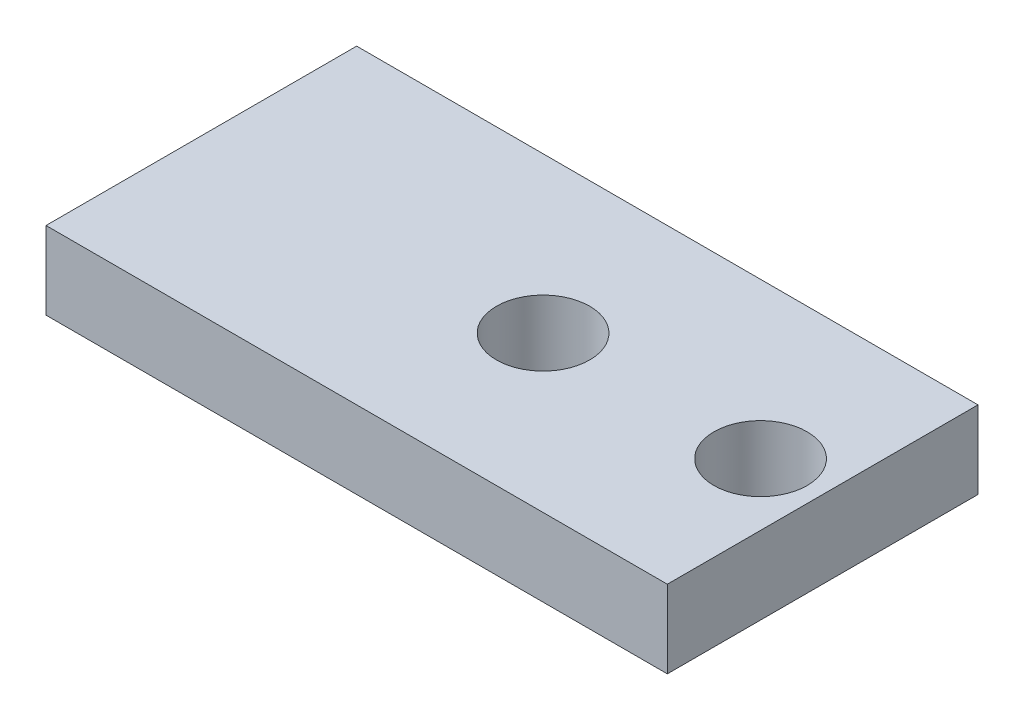
ISO-10303-21;
HEADER;
FILE_DESCRIPTION(('STEP AP214'),'2;1');
FILE_NAME('part.step','',(''),(''),'','','');
FILE_SCHEMA(('AUTOMOTIVE_DESIGN { 1 0 10303 214 1 1 1 1 }'));
ENDSEC;
DATA;
#1=APPLICATION_CONTEXT('core data for automotive mechanical design processes');
#2=APPLICATION_PROTOCOL_DEFINITION('international standard','automotive_design',2000,#1);
#3=PRODUCT_CONTEXT('',#1,'mechanical');
#4=PRODUCT('Part','Part','',(#3));
#5=PRODUCT_RELATED_PRODUCT_CATEGORY('part','',(#4));
#6=PRODUCT_DEFINITION_FORMATION('','',#4);
#7=PRODUCT_DEFINITION_CONTEXT('part definition',#1,'design');
#8=PRODUCT_DEFINITION('design','',#6,#7);
#9=PRODUCT_DEFINITION_SHAPE('','',#8);
#10=(LENGTH_UNIT() NAMED_UNIT(*) SI_UNIT(.MILLI.,.METRE.));
#11=(NAMED_UNIT(*) PLANE_ANGLE_UNIT() SI_UNIT($,.RADIAN.));
#12=(NAMED_UNIT(*) SI_UNIT($,.STERADIAN.) SOLID_ANGLE_UNIT());
#13=UNCERTAINTY_MEASURE_WITH_UNIT(LENGTH_MEASURE(1.E-05),#10,'distance_accuracy_value','');
#14=(GEOMETRIC_REPRESENTATION_CONTEXT(3) GLOBAL_UNCERTAINTY_ASSIGNED_CONTEXT((#13)) GLOBAL_UNIT_ASSIGNED_CONTEXT((#10,
#11,#12)) REPRESENTATION_CONTEXT('',''));
#15=CARTESIAN_POINT('',(0.,0.,0.));
#16=DIRECTION('',(0.,0.,1.));
#17=DIRECTION('',(1.,0.,0.));
#18=AXIS2_PLACEMENT_3D('',#15,#16,#17);
#19=CARTESIAN_POINT('',(20.,5.,-10.));
#20=DIRECTION('',(-1.,0.,0.));
#21=DIRECTION('',(0.,0.,1.));
#22=AXIS2_PLACEMENT_3D('',#19,#20,#21);
#23=PLANE('',#22);
#24=DIRECTION('',(0.,0.,-1.));
#25=VECTOR('',#24,1.);
#26=CARTESIAN_POINT('',(20.,0.,-10.));
#27=LINE('',#26,#25);
#28=CARTESIAN_POINT('',(20.,0.,10.));
#29=VERTEX_POINT('',#28);
#30=CARTESIAN_POINT('',(20.,0.,-10.));
#31=VERTEX_POINT('',#30);
#32=EDGE_CURVE('E97',#29,#31,#27,.T.);
#33=ORIENTED_EDGE('',*,*,#32,.T.);
#34=DIRECTION('',(0.,-1.,0.));
#35=VECTOR('',#34,1.);
#36=CARTESIAN_POINT('',(20.,5.,-10.));
#37=LINE('',#36,#35);
#38=CARTESIAN_POINT('',(20.,5.,-10.));
#39=VERTEX_POINT('',#38);
#40=EDGE_CURVE('E11',#39,#31,#37,.T.);
#41=ORIENTED_EDGE('',*,*,#40,.F.);
#42=DIRECTION('',(0.,0.,-1.));
#43=VECTOR('',#42,1.);
#44=CARTESIAN_POINT('',(20.,5.,-10.));
#45=LINE('',#44,#43);
#46=CARTESIAN_POINT('',(20.,5.,10.));
#47=VERTEX_POINT('',#46);
#48=EDGE_CURVE('E85',#47,#39,#45,.T.);
#49=ORIENTED_EDGE('',*,*,#48,.F.);
#50=DIRECTION('',(0.,-1.,0.));
#51=VECTOR('',#50,1.);
#52=CARTESIAN_POINT('',(20.,5.,10.));
#53=LINE('',#52,#51);
#54=EDGE_CURVE('E93',#47,#29,#53,.T.);
#55=ORIENTED_EDGE('',*,*,#54,.T.);
#56=EDGE_LOOP('',(#33,#41,#49,#55));
#57=FACE_BOUND('',#56,.T.);
#58=ADVANCED_FACE('F34',(#57),#23,.F.);
#59=CARTESIAN_POINT('',(-20.,5.,-10.));
#60=DIRECTION('',(0.,0.,1.));
#61=DIRECTION('',(1.,0.,0.));
#62=AXIS2_PLACEMENT_3D('',#59,#60,#61);
#63=PLANE('',#62);
#64=DIRECTION('',(-1.,0.,0.));
#65=VECTOR('',#64,1.);
#66=CARTESIAN_POINT('',(-20.,0.,-10.));
#67=LINE('',#66,#65);
#68=CARTESIAN_POINT('',(-20.,0.,-10.));
#69=VERTEX_POINT('',#68);
#70=EDGE_CURVE('E89',#31,#69,#67,.T.);
#71=ORIENTED_EDGE('',*,*,#70,.T.);
#72=DIRECTION('',(0.,-1.,0.));
#73=VECTOR('',#72,1.);
#74=CARTESIAN_POINT('',(-20.,5.,-10.));
#75=LINE('',#74,#73);
#76=CARTESIAN_POINT('',(-20.,5.,-10.));
#77=VERTEX_POINT('',#76);
#78=EDGE_CURVE('E42',#77,#69,#75,.T.);
#79=ORIENTED_EDGE('',*,*,#78,.F.);
#80=DIRECTION('',(-1.,0.,0.));
#81=VECTOR('',#80,1.);
#82=CARTESIAN_POINT('',(-20.,5.,-10.));
#83=LINE('',#82,#81);
#84=EDGE_CURVE('E80',#39,#77,#83,.T.);
#85=ORIENTED_EDGE('',*,*,#84,.F.);
#86=ORIENTED_EDGE('',*,*,#40,.T.);
#87=EDGE_LOOP('',(#71,#79,#85,#86));
#88=FACE_BOUND('',#87,.T.);
#89=ADVANCED_FACE('F88',(#88),#63,.F.);
#90=CARTESIAN_POINT('',(-20.,5.,-10.));
#91=DIRECTION('',(1.,0.,0.));
#92=DIRECTION('',(0.,0.,-1.));
#93=AXIS2_PLACEMENT_3D('',#90,#91,#92);
#94=PLANE('',#93);
#95=DIRECTION('',(0.,0.,1.));
#96=VECTOR('',#95,1.);
#97=CARTESIAN_POINT('',(-20.,0.,-10.));
#98=LINE('',#97,#96);
#99=CARTESIAN_POINT('',(-20.,0.,10.));
#100=VERTEX_POINT('',#99);
#101=EDGE_CURVE('E67',#69,#100,#98,.T.);
#102=ORIENTED_EDGE('',*,*,#101,.T.);
#103=DIRECTION('',(0.,-1.,0.));
#104=VECTOR('',#103,1.);
#105=CARTESIAN_POINT('',(-20.,5.,10.));
#106=LINE('',#105,#104);
#107=CARTESIAN_POINT('',(-20.,5.,10.));
#108=VERTEX_POINT('',#107);
#109=EDGE_CURVE('E90',#108,#100,#106,.T.);
#110=ORIENTED_EDGE('',*,*,#109,.F.);
#111=DIRECTION('',(0.,0.,1.));
#112=VECTOR('',#111,1.);
#113=CARTESIAN_POINT('',(-20.,5.,-10.));
#114=LINE('',#113,#112);
#115=EDGE_CURVE('E83',#77,#108,#114,.T.);
#116=ORIENTED_EDGE('',*,*,#115,.F.);
#117=ORIENTED_EDGE('',*,*,#78,.T.);
#118=EDGE_LOOP('',(#102,#110,#116,#117));
#119=FACE_BOUND('',#118,.T.);
#120=ADVANCED_FACE('F91',(#119),#94,.F.);
#121=CARTESIAN_POINT('',(-20.,5.,10.));
#122=DIRECTION('',(0.,0.,-1.));
#123=DIRECTION('',(-1.,0.,0.));
#124=AXIS2_PLACEMENT_3D('',#121,#122,#123);
#125=PLANE('',#124);
#126=DIRECTION('',(1.,0.,0.));
#127=VECTOR('',#126,1.);
#128=CARTESIAN_POINT('',(-20.,0.,10.));
#129=LINE('',#128,#127);
#130=EDGE_CURVE('E73',#100,#29,#129,.T.);
#131=ORIENTED_EDGE('',*,*,#130,.T.);
#132=ORIENTED_EDGE('',*,*,#54,.F.);
#133=DIRECTION('',(1.,0.,0.));
#134=VECTOR('',#133,1.);
#135=CARTESIAN_POINT('',(-20.,5.,10.));
#136=LINE('',#135,#134);
#137=EDGE_CURVE('E50',#108,#47,#136,.T.);
#138=ORIENTED_EDGE('',*,*,#137,.F.);
#139=ORIENTED_EDGE('',*,*,#109,.T.);
#140=EDGE_LOOP('',(#131,#132,#138,#139));
#141=FACE_BOUND('',#140,.T.);
#142=ADVANCED_FACE('F105',(#141),#125,.F.);
#143=CARTESIAN_POINT('',(0.,5.,0.));
#144=DIRECTION('',(0.,1.,0.));
#145=DIRECTION('',(0.,0.,1.));
#146=AXIS2_PLACEMENT_3D('',#143,#144,#145);
#147=PLANE('',#146);
#148=CARTESIAN_POINT('',(16.,5.,0.));
#149=DIRECTION('',(0.,1.,0.));
#150=DIRECTION('',(0.,0.,1.));
#151=AXIS2_PLACEMENT_3D('',#148,#149,#150);
#152=CIRCLE('',#151,2.99999999999999);
#153=CARTESIAN_POINT('',(16.,5.,2.99999999999999));
#154=VERTEX_POINT('',#153);
#155=EDGE_CURVE('E116',#154,#154,#152,.T.);
#156=ORIENTED_EDGE('',*,*,#155,.F.);
#157=EDGE_LOOP('',(#156));
#158=FACE_BOUND('',#157,.T.);
#159=CARTESIAN_POINT('',(2.,5.,0.));
#160=DIRECTION('',(0.,1.,0.));
#161=DIRECTION('',(0.,0.,1.));
#162=AXIS2_PLACEMENT_3D('',#159,#160,#161);
#163=CIRCLE('',#162,2.99999999999999);
#164=CARTESIAN_POINT('',(2.,5.,2.99999999999999));
#165=VERTEX_POINT('',#164);
#166=EDGE_CURVE('E100',#165,#165,#163,.T.);
#167=ORIENTED_EDGE('',*,*,#166,.F.);
#168=EDGE_LOOP('',(#167));
#169=FACE_BOUND('',#168,.T.);
#170=ORIENTED_EDGE('',*,*,#48,.T.);
#171=ORIENTED_EDGE('',*,*,#84,.T.);
#172=ORIENTED_EDGE('',*,*,#115,.T.);
#173=ORIENTED_EDGE('',*,*,#137,.T.);
#174=EDGE_LOOP('',(#170,#171,#172,#173));
#175=FACE_BOUND('',#174,.T.);
#176=ADVANCED_FACE('F81',(#158,#169,#175),#147,.T.);
#177=CARTESIAN_POINT('',(0.,0.,0.));
#178=DIRECTION('',(0.,1.,0.));
#179=DIRECTION('',(0.,0.,1.));
#180=AXIS2_PLACEMENT_3D('',#177,#178,#179);
#181=PLANE('',#180);
#182=CARTESIAN_POINT('',(16.,0.,0.));
#183=DIRECTION('',(0.,-1.,0.));
#184=DIRECTION('',(0.,0.,-1.));
#185=AXIS2_PLACEMENT_3D('',#182,#183,#184);
#186=CIRCLE('',#185,2.99999999999999);
#187=CARTESIAN_POINT('',(16.,0.,-2.99999999999999));
#188=VERTEX_POINT('',#187);
#189=EDGE_CURVE('E119',#188,#188,#186,.T.);
#190=ORIENTED_EDGE('',*,*,#189,.F.);
#191=EDGE_LOOP('',(#190));
#192=FACE_BOUND('',#191,.T.);
#193=CARTESIAN_POINT('',(2.,0.,0.));
#194=DIRECTION('',(0.,-1.,0.));
#195=DIRECTION('',(0.,0.,-1.));
#196=AXIS2_PLACEMENT_3D('',#193,#194,#195);
#197=CIRCLE('',#196,2.99999999999999);
#198=CARTESIAN_POINT('',(2.,0.,-2.99999999999999));
#199=VERTEX_POINT('',#198);
#200=EDGE_CURVE('E113',#199,#199,#197,.T.);
#201=ORIENTED_EDGE('',*,*,#200,.F.);
#202=EDGE_LOOP('',(#201));
#203=FACE_BOUND('',#202,.T.);
#204=ORIENTED_EDGE('',*,*,#32,.F.);
#205=ORIENTED_EDGE('',*,*,#130,.F.);
#206=ORIENTED_EDGE('',*,*,#101,.F.);
#207=ORIENTED_EDGE('',*,*,#70,.F.);
#208=EDGE_LOOP('',(#204,#205,#206,#207));
#209=FACE_BOUND('',#208,.T.);
#210=ADVANCED_FACE('F108',(#192,#203,#209),#181,.F.);
#211=CARTESIAN_POINT('',(2.,0.,0.));
#212=DIRECTION('',(0.,-1.,0.));
#213=DIRECTION('',(0.,0.,-1.));
#214=AXIS2_PLACEMENT_3D('',#211,#212,#213);
#215=CYLINDRICAL_SURFACE('',#214,2.99999999999999);
#216=ORIENTED_EDGE('',*,*,#166,.T.);
#217=EDGE_LOOP('',(#216));
#218=FACE_BOUND('',#217,.T.);
#219=ORIENTED_EDGE('',*,*,#200,.T.);
#220=EDGE_LOOP('',(#219));
#221=FACE_BOUND('',#220,.T.);
#222=ADVANCED_FACE('F127',(#218,#221),#215,.F.);
#223=CARTESIAN_POINT('',(16.,0.,0.));
#224=DIRECTION('',(0.,-1.,0.));
#225=DIRECTION('',(0.,0.,-1.));
#226=AXIS2_PLACEMENT_3D('',#223,#224,#225);
#227=CYLINDRICAL_SURFACE('',#226,2.99999999999999);
#228=ORIENTED_EDGE('',*,*,#155,.T.);
#229=EDGE_LOOP('',(#228));
#230=FACE_BOUND('',#229,.T.);
#231=ORIENTED_EDGE('',*,*,#189,.T.);
#232=EDGE_LOOP('',(#231));
#233=FACE_BOUND('',#232,.T.);
#234=ADVANCED_FACE('F123',(#230,#233),#227,.F.);
#235=CLOSED_SHELL('',(#58,#89,#120,#142,#176,#210,#222,#234));
#236=MANIFOLD_SOLID_BREP('B2',#235);
#237=ADVANCED_BREP_SHAPE_REPRESENTATION('',(#18,#236),#14);
#238=SHAPE_DEFINITION_REPRESENTATION(#9,#237);
ENDSEC;
END-ISO-10303-21;
